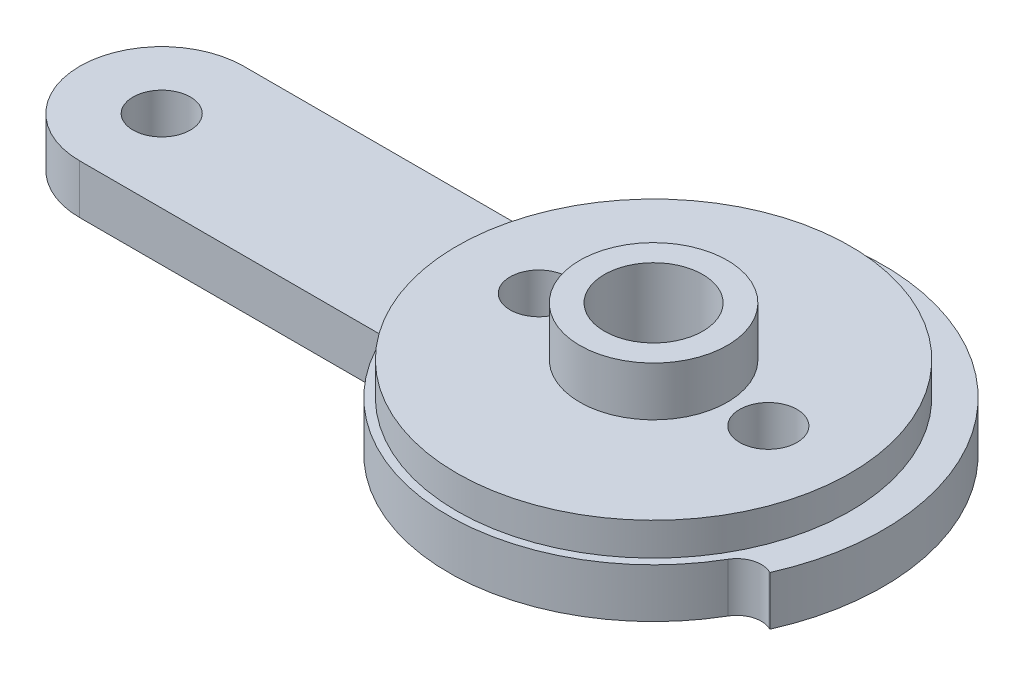
ISO-10303-21;
HEADER;
FILE_DESCRIPTION(('STEP AP214'),'2;1');
FILE_NAME('part.step','',(''),(''),'','','');
FILE_SCHEMA(('AUTOMOTIVE_DESIGN { 1 0 10303 214 1 1 1 1 }'));
ENDSEC;
DATA;
#1=APPLICATION_CONTEXT('core data for automotive mechanical design processes');
#2=APPLICATION_PROTOCOL_DEFINITION('international standard','automotive_design',2000,#1);
#3=PRODUCT_CONTEXT('',#1,'mechanical');
#4=PRODUCT('Part','Part','',(#3));
#5=PRODUCT_RELATED_PRODUCT_CATEGORY('part','',(#4));
#6=PRODUCT_DEFINITION_FORMATION('','',#4);
#7=PRODUCT_DEFINITION_CONTEXT('part definition',#1,'design');
#8=PRODUCT_DEFINITION('design','',#6,#7);
#9=PRODUCT_DEFINITION_SHAPE('','',#8);
#10=(LENGTH_UNIT() NAMED_UNIT(*) SI_UNIT(.MILLI.,.METRE.));
#11=(NAMED_UNIT(*) PLANE_ANGLE_UNIT() SI_UNIT($,.RADIAN.));
#12=(NAMED_UNIT(*) SI_UNIT($,.STERADIAN.) SOLID_ANGLE_UNIT());
#13=UNCERTAINTY_MEASURE_WITH_UNIT(LENGTH_MEASURE(1.E-05),#10,'distance_accuracy_value','');
#14=(GEOMETRIC_REPRESENTATION_CONTEXT(3) GLOBAL_UNCERTAINTY_ASSIGNED_CONTEXT((#13)) GLOBAL_UNIT_ASSIGNED_CONTEXT((#10,
#11,#12)) REPRESENTATION_CONTEXT('',''));
#15=CARTESIAN_POINT('',(0.,0.,0.));
#16=DIRECTION('',(0.,0.,1.));
#17=DIRECTION('',(1.,0.,0.));
#18=AXIS2_PLACEMENT_3D('',#15,#16,#17);
#19=CARTESIAN_POINT('',(12.1059096426056,3.,7.0318526524003));
#20=DIRECTION('',(0.,-1.,0.));
#21=DIRECTION('',(0.,0.,-1.));
#22=AXIS2_PLACEMENT_3D('',#19,#20,#21);
#23=PLANE('',#22);
#24=CARTESIAN_POINT('',(0.,3.,0.));
#25=DIRECTION('',(0.,1.,0.));
#26=DIRECTION('',(0.,0.,1.));
#27=AXIS2_PLACEMENT_3D('',#24,#25,#26);
#28=CIRCLE('',#27,12.);
#29=CARTESIAN_POINT('',(0.,3.,12.));
#30=VERTEX_POINT('',#29);
#31=EDGE_CURVE('E11',#30,#30,#28,.T.);
#32=ORIENTED_EDGE('',*,*,#31,.F.);
#33=EDGE_LOOP('',(#32));
#34=FACE_BOUND('',#33,.T.);
#35=CARTESIAN_POINT('',(12.1059096426056,3.,7.0318526524003));
#36=DIRECTION('',(0.,-1.,0.));
#37=DIRECTION('',(0.,0.,-1.));
#38=AXIS2_PLACEMENT_3D('',#35,#36,#37);
#39=CIRCLE('',#38,1.5);
#40=CARTESIAN_POINT('',(10.8088478951836,3.,6.27843986821455));
#41=VERTEX_POINT('',#40);
#42=CARTESIAN_POINT('',(12.7160146072193,3.,5.6615344659364));
#43=VERTEX_POINT('',#42);
#44=EDGE_CURVE('E189',#41,#43,#39,.T.);
#45=ORIENTED_EDGE('',*,*,#44,.T.);
#46=DIRECTION('',(0.913545457642601,0.,0.4067366430758));
#47=VECTOR('',#46,1.);
#48=CARTESIAN_POINT('',(12.7160146072193,3.,5.6615344659364));
#49=LINE('',#48,#47);
#50=CARTESIAN_POINT('',(12.7896364069964,3.,5.69431300306121));
#51=VERTEX_POINT('',#50);
#52=EDGE_CURVE('E110',#43,#51,#49,.T.);
#53=ORIENTED_EDGE('',*,*,#52,.T.);
#54=CARTESIAN_POINT('',(0.,3.,0.));
#55=DIRECTION('',(0.,1.,0.));
#56=DIRECTION('',(0.,0.,1.));
#57=AXIS2_PLACEMENT_3D('',#54,#55,#56);
#58=CIRCLE('',#57,14.);
#59=CARTESIAN_POINT('',(-8.61926065455927,3.,-11.0321505504941));
#60=VERTEX_POINT('',#59);
#61=EDGE_CURVE('E271',#51,#60,#58,.T.);
#62=ORIENTED_EDGE('',*,*,#61,.T.);
#63=DIRECTION('',(0.61566147532566,0.,0.788010753606721));
#64=VECTOR('',#63,1.);
#65=CARTESIAN_POINT('',(-8.56964505471394,3.,-10.9686454786458));
#66=LINE('',#65,#64);
#67=CARTESIAN_POINT('',(-8.56964505471394,3.,-10.9686454786458));
#68=VERTEX_POINT('',#67);
#69=EDGE_CURVE('E274',#60,#68,#66,.T.);
#70=ORIENTED_EDGE('',*,*,#69,.T.);
#71=CARTESIAN_POINT('',(-9.75166118512402,3.,-10.0451532656573));
#72=DIRECTION('',(0.,-1.,0.));
#73=DIRECTION('',(0.,0.,-1.));
#74=AXIS2_PLACEMENT_3D('',#71,#72,#73);
#75=CIRCLE('',#74,1.5);
#76=CARTESIAN_POINT('',(-8.70684034386073,3.,-8.96888684433688));
#77=VERTEX_POINT('',#76);
#78=EDGE_CURVE('E277',#68,#77,#75,.T.);
#79=ORIENTED_EDGE('',*,*,#78,.T.);
#80=CARTESIAN_POINT('',(0.,3.,0.));
#81=DIRECTION('',(0.,1.,0.));
#82=DIRECTION('',(0.,0.,1.));
#83=AXIS2_PLACEMENT_3D('',#80,#81,#82);
#84=CIRCLE('',#83,12.5);
#85=CARTESIAN_POINT('',(-11.4564392373896,3.,-5.));
#86=VERTEX_POINT('',#85);
#87=EDGE_CURVE('E280',#77,#86,#84,.T.);
#88=ORIENTED_EDGE('',*,*,#87,.T.);
#89=DIRECTION('',(-1.,0.,0.));
#90=VECTOR('',#89,1.);
#91=CARTESIAN_POINT('',(-30.,3.,-5.));
#92=LINE('',#91,#90);
#93=CARTESIAN_POINT('',(-30.,3.,-5.));
#94=VERTEX_POINT('',#93);
#95=EDGE_CURVE('E135',#86,#94,#92,.T.);
#96=ORIENTED_EDGE('',*,*,#95,.T.);
#97=CARTESIAN_POINT('',(-30.,3.,0.));
#98=DIRECTION('',(0.,1.,0.));
#99=DIRECTION('',(0.,0.,1.));
#100=AXIS2_PLACEMENT_3D('',#97,#98,#99);
#101=CIRCLE('',#100,5.);
#102=CARTESIAN_POINT('',(-30.,3.,5.));
#103=VERTEX_POINT('',#102);
#104=EDGE_CURVE('E129',#94,#103,#101,.T.);
#105=ORIENTED_EDGE('',*,*,#104,.T.);
#106=DIRECTION('',(1.,0.,0.));
#107=VECTOR('',#106,1.);
#108=CARTESIAN_POINT('',(-30.,3.,5.));
#109=LINE('',#108,#107);
#110=CARTESIAN_POINT('',(-11.4564392373896,3.,5.00000000000001));
#111=VERTEX_POINT('',#110);
#112=EDGE_CURVE('E133',#103,#111,#109,.T.);
#113=ORIENTED_EDGE('',*,*,#112,.T.);
#114=CARTESIAN_POINT('',(0.,3.,0.));
#115=DIRECTION('',(0.,1.,0.));
#116=DIRECTION('',(0.,0.,1.));
#117=AXIS2_PLACEMENT_3D('',#114,#115,#116);
#118=CIRCLE('',#117,12.5);
#119=EDGE_CURVE('E60',#111,#41,#118,.T.);
#120=ORIENTED_EDGE('',*,*,#119,.T.);
#121=EDGE_LOOP('',(#45,#53,#62,#70,#79,#88,#96,#105,#113,#120));
#122=FACE_BOUND('',#121,.T.);
#123=CARTESIAN_POINT('',(-30.,3.,0.));
#124=DIRECTION('',(0.,1.,0.));
#125=DIRECTION('',(0.,0.,1.));
#126=AXIS2_PLACEMENT_3D('',#123,#124,#125);
#127=CIRCLE('',#126,1.75);
#128=CARTESIAN_POINT('',(-30.,3.,1.75));
#129=VERTEX_POINT('',#128);
#130=EDGE_CURVE('E165',#129,#129,#127,.T.);
#131=ORIENTED_EDGE('',*,*,#130,.F.);
#132=EDGE_LOOP('',(#131));
#133=FACE_BOUND('',#132,.T.);
#134=ADVANCED_FACE('F40',(#34,#122,#133),#23,.F.);
#135=CARTESIAN_POINT('',(12.1059096426056,0.,7.0318526524003));
#136=DIRECTION('',(0.,-1.,0.));
#137=DIRECTION('',(0.,0.,-1.));
#138=AXIS2_PLACEMENT_3D('',#135,#136,#137);
#139=PLANE('',#138);
#140=CARTESIAN_POINT('',(7.,0.,0.));
#141=DIRECTION('',(0.,1.,0.));
#142=DIRECTION('',(0.,0.,1.));
#143=AXIS2_PLACEMENT_3D('',#140,#141,#142);
#144=CIRCLE('',#143,1.75);
#145=CARTESIAN_POINT('',(7.,0.,1.75));
#146=VERTEX_POINT('',#145);
#147=EDGE_CURVE('E306',#146,#146,#144,.T.);
#148=ORIENTED_EDGE('',*,*,#147,.T.);
#149=EDGE_LOOP('',(#148));
#150=FACE_BOUND('',#149,.T.);
#151=CARTESIAN_POINT('',(-7.,0.,0.));
#152=DIRECTION('',(0.,1.,0.));
#153=DIRECTION('',(0.,0.,1.));
#154=AXIS2_PLACEMENT_3D('',#151,#152,#153);
#155=CIRCLE('',#154,1.75);
#156=CARTESIAN_POINT('',(-7.,0.,1.75));
#157=VERTEX_POINT('',#156);
#158=EDGE_CURVE('E285',#157,#157,#155,.T.);
#159=ORIENTED_EDGE('',*,*,#158,.T.);
#160=EDGE_LOOP('',(#159));
#161=FACE_BOUND('',#160,.T.);
#162=CARTESIAN_POINT('',(0.,0.,0.));
#163=DIRECTION('',(0.,1.,0.));
#164=DIRECTION('',(0.,0.,1.));
#165=AXIS2_PLACEMENT_3D('',#162,#163,#164);
#166=CIRCLE('',#165,1.75);
#167=CARTESIAN_POINT('',(0.,0.,1.75));
#168=VERTEX_POINT('',#167);
#169=EDGE_CURVE('E222',#168,#168,#166,.T.);
#170=ORIENTED_EDGE('',*,*,#169,.T.);
#171=EDGE_LOOP('',(#170));
#172=FACE_BOUND('',#171,.T.);
#173=CARTESIAN_POINT('',(12.1059096426056,0.,7.0318526524003));
#174=DIRECTION('',(0.,-1.,0.));
#175=DIRECTION('',(0.,0.,-1.));
#176=AXIS2_PLACEMENT_3D('',#173,#174,#175);
#177=CIRCLE('',#176,1.5);
#178=CARTESIAN_POINT('',(10.8088478951836,0.,6.27843986821455));
#179=VERTEX_POINT('',#178);
#180=CARTESIAN_POINT('',(12.7160146072193,0.,5.6615344659364));
#181=VERTEX_POINT('',#180);
#182=EDGE_CURVE('E160',#179,#181,#177,.T.);
#183=ORIENTED_EDGE('',*,*,#182,.F.);
#184=CARTESIAN_POINT('',(0.,0.,0.));
#185=DIRECTION('',(0.,1.,0.));
#186=DIRECTION('',(0.,0.,1.));
#187=AXIS2_PLACEMENT_3D('',#184,#185,#186);
#188=CIRCLE('',#187,12.5);
#189=CARTESIAN_POINT('',(-11.4564392373896,0.,5.00000000000001));
#190=VERTEX_POINT('',#189);
#191=EDGE_CURVE('E101',#190,#179,#188,.T.);
#192=ORIENTED_EDGE('',*,*,#191,.F.);
#193=DIRECTION('',(1.,0.,0.));
#194=VECTOR('',#193,1.);
#195=CARTESIAN_POINT('',(-30.,0.,5.));
#196=LINE('',#195,#194);
#197=CARTESIAN_POINT('',(-30.,0.,5.));
#198=VERTEX_POINT('',#197);
#199=EDGE_CURVE('E95',#198,#190,#196,.T.);
#200=ORIENTED_EDGE('',*,*,#199,.F.);
#201=CARTESIAN_POINT('',(-30.,0.,0.));
#202=DIRECTION('',(0.,1.,0.));
#203=DIRECTION('',(0.,0.,1.));
#204=AXIS2_PLACEMENT_3D('',#201,#202,#203);
#205=CIRCLE('',#204,5.);
#206=CARTESIAN_POINT('',(-30.,0.,-5.));
#207=VERTEX_POINT('',#206);
#208=EDGE_CURVE('E144',#207,#198,#205,.T.);
#209=ORIENTED_EDGE('',*,*,#208,.F.);
#210=DIRECTION('',(-1.,0.,0.));
#211=VECTOR('',#210,1.);
#212=CARTESIAN_POINT('',(-30.,0.,-5.));
#213=LINE('',#212,#211);
#214=CARTESIAN_POINT('',(-11.4564392373896,0.,-5.));
#215=VERTEX_POINT('',#214);
#216=EDGE_CURVE('E180',#215,#207,#213,.T.);
#217=ORIENTED_EDGE('',*,*,#216,.F.);
#218=CARTESIAN_POINT('',(0.,0.,0.));
#219=DIRECTION('',(0.,1.,0.));
#220=DIRECTION('',(0.,0.,1.));
#221=AXIS2_PLACEMENT_3D('',#218,#219,#220);
#222=CIRCLE('',#221,12.5);
#223=CARTESIAN_POINT('',(-8.70684034386073,0.,-8.96888684433688));
#224=VERTEX_POINT('',#223);
#225=EDGE_CURVE('E177',#224,#215,#222,.T.);
#226=ORIENTED_EDGE('',*,*,#225,.F.);
#227=CARTESIAN_POINT('',(-9.75166118512402,0.,-10.0451532656573));
#228=DIRECTION('',(0.,-1.,0.));
#229=DIRECTION('',(0.,0.,-1.));
#230=AXIS2_PLACEMENT_3D('',#227,#228,#229);
#231=CIRCLE('',#230,1.5);
#232=CARTESIAN_POINT('',(-8.56964505471394,0.,-10.9686454786458));
#233=VERTEX_POINT('',#232);
#234=EDGE_CURVE('E174',#233,#224,#231,.T.);
#235=ORIENTED_EDGE('',*,*,#234,.F.);
#236=DIRECTION('',(0.61566147532566,0.,0.788010753606721));
#237=VECTOR('',#236,1.);
#238=CARTESIAN_POINT('',(-8.56964505471394,0.,-10.9686454786458));
#239=LINE('',#238,#237);
#240=CARTESIAN_POINT('',(-8.61926065455927,0.,-11.0321505504941));
#241=VERTEX_POINT('',#240);
#242=EDGE_CURVE('E171',#241,#233,#239,.T.);
#243=ORIENTED_EDGE('',*,*,#242,.F.);
#244=CARTESIAN_POINT('',(0.,0.,0.));
#245=DIRECTION('',(0.,1.,0.));
#246=DIRECTION('',(0.,0.,1.));
#247=AXIS2_PLACEMENT_3D('',#244,#245,#246);
#248=CIRCLE('',#247,14.);
#249=CARTESIAN_POINT('',(12.7896364069964,0.,5.69431300306121));
#250=VERTEX_POINT('',#249);
#251=EDGE_CURVE('E168',#250,#241,#248,.T.);
#252=ORIENTED_EDGE('',*,*,#251,.F.);
#253=DIRECTION('',(0.913545457642601,0.,0.4067366430758));
#254=VECTOR('',#253,1.);
#255=CARTESIAN_POINT('',(12.7160146072193,0.,5.6615344659364));
#256=LINE('',#255,#254);
#257=EDGE_CURVE('E164',#181,#250,#256,.T.);
#258=ORIENTED_EDGE('',*,*,#257,.F.);
#259=EDGE_LOOP('',(#183,#192,#200,#209,#217,#226,#235,#243,#252,#258));
#260=FACE_BOUND('',#259,.T.);
#261=CARTESIAN_POINT('',(-30.,0.,0.));
#262=DIRECTION('',(0.,1.,0.));
#263=DIRECTION('',(0.,0.,1.));
#264=AXIS2_PLACEMENT_3D('',#261,#262,#263);
#265=CIRCLE('',#264,1.75);
#266=CARTESIAN_POINT('',(-30.,0.,1.75));
#267=VERTEX_POINT('',#266);
#268=EDGE_CURVE('E261',#267,#267,#265,.T.);
#269=ORIENTED_EDGE('',*,*,#268,.T.);
#270=EDGE_LOOP('',(#269));
#271=FACE_BOUND('',#270,.T.);
#272=ADVANCED_FACE('F317',(#150,#161,#172,#260,#271),#139,.T.);
#273=CARTESIAN_POINT('',(12.1059096426056,3.,7.0318526524003));
#274=DIRECTION('',(0.,-1.,0.));
#275=DIRECTION('',(0.,0.,-1.));
#276=AXIS2_PLACEMENT_3D('',#273,#274,#275);
#277=CYLINDRICAL_SURFACE('',#276,1.5);
#278=ORIENTED_EDGE('',*,*,#182,.T.);
#279=DIRECTION('',(0.,-1.,0.));
#280=VECTOR('',#279,1.);
#281=CARTESIAN_POINT('',(12.7160146072193,3.,5.6615344659364));
#282=LINE('',#281,#280);
#283=EDGE_CURVE('E51',#43,#181,#282,.T.);
#284=ORIENTED_EDGE('',*,*,#283,.F.);
#285=ORIENTED_EDGE('',*,*,#44,.F.);
#286=DIRECTION('',(0.,-1.,0.));
#287=VECTOR('',#286,1.);
#288=CARTESIAN_POINT('',(10.8088478951836,3.,6.27843986821455));
#289=LINE('',#288,#287);
#290=EDGE_CURVE('E156',#41,#179,#289,.T.);
#291=ORIENTED_EDGE('',*,*,#290,.T.);
#292=EDGE_LOOP('',(#278,#284,#285,#291));
#293=FACE_BOUND('',#292,.T.);
#294=ADVANCED_FACE('F42',(#293),#277,.F.);
#295=CARTESIAN_POINT('',(12.7160146072193,3.,5.6615344659364));
#296=DIRECTION('',(0.4067366430758,0.,-0.913545457642601));
#297=DIRECTION('',(-0.913545457642601,0.,-0.4067366430758));
#298=AXIS2_PLACEMENT_3D('',#295,#296,#297);
#299=PLANE('',#298);
#300=ORIENTED_EDGE('',*,*,#257,.T.);
#301=DIRECTION('',(0.,-1.,0.));
#302=VECTOR('',#301,1.);
#303=CARTESIAN_POINT('',(12.7896364069964,3.,5.69431300306121));
#304=LINE('',#303,#302);
#305=EDGE_CURVE('E212',#51,#250,#304,.T.);
#306=ORIENTED_EDGE('',*,*,#305,.F.);
#307=ORIENTED_EDGE('',*,*,#52,.F.);
#308=ORIENTED_EDGE('',*,*,#283,.T.);
#309=EDGE_LOOP('',(#300,#306,#307,#308));
#310=FACE_BOUND('',#309,.T.);
#311=ADVANCED_FACE('F371',(#310),#299,.F.);
#312=CARTESIAN_POINT('',(0.,3.,0.));
#313=DIRECTION('',(0.,-1.,0.));
#314=DIRECTION('',(0.,0.,-1.));
#315=AXIS2_PLACEMENT_3D('',#312,#313,#314);
#316=CYLINDRICAL_SURFACE('',#315,14.);
#317=ORIENTED_EDGE('',*,*,#251,.T.);
#318=DIRECTION('',(0.,-1.,0.));
#319=VECTOR('',#318,1.);
#320=CARTESIAN_POINT('',(-8.61926065455927,3.,-11.0321505504941));
#321=LINE('',#320,#319);
#322=EDGE_CURVE('E208',#60,#241,#321,.T.);
#323=ORIENTED_EDGE('',*,*,#322,.F.);
#324=ORIENTED_EDGE('',*,*,#61,.F.);
#325=ORIENTED_EDGE('',*,*,#305,.T.);
#326=EDGE_LOOP('',(#317,#323,#324,#325));
#327=FACE_BOUND('',#326,.T.);
#328=ADVANCED_FACE('F368',(#327),#316,.T.);
#329=CARTESIAN_POINT('',(-8.56964505471394,3.,-10.9686454786458));
#330=DIRECTION('',(0.788010753606721,0.,-0.61566147532566));
#331=DIRECTION('',(-0.61566147532566,0.,-0.788010753606721));
#332=AXIS2_PLACEMENT_3D('',#329,#330,#331);
#333=PLANE('',#332);
#334=ORIENTED_EDGE('',*,*,#242,.T.);
#335=DIRECTION('',(0.,-1.,0.));
#336=VECTOR('',#335,1.);
#337=CARTESIAN_POINT('',(-8.56964505471394,3.,-10.9686454786458));
#338=LINE('',#337,#336);
#339=EDGE_CURVE('E204',#68,#233,#338,.T.);
#340=ORIENTED_EDGE('',*,*,#339,.F.);
#341=ORIENTED_EDGE('',*,*,#69,.F.);
#342=ORIENTED_EDGE('',*,*,#322,.T.);
#343=EDGE_LOOP('',(#334,#340,#341,#342));
#344=FACE_BOUND('',#343,.T.);
#345=ADVANCED_FACE('F364',(#344),#333,.F.);
#346=CARTESIAN_POINT('',(-9.75166118512402,3.,-10.0451532656573));
#347=DIRECTION('',(0.,-1.,0.));
#348=DIRECTION('',(0.,0.,-1.));
#349=AXIS2_PLACEMENT_3D('',#346,#347,#348);
#350=CYLINDRICAL_SURFACE('',#349,1.5);
#351=ORIENTED_EDGE('',*,*,#234,.T.);
#352=DIRECTION('',(0.,-1.,0.));
#353=VECTOR('',#352,1.);
#354=CARTESIAN_POINT('',(-8.70684034386073,3.,-8.96888684433688));
#355=LINE('',#354,#353);
#356=EDGE_CURVE('E200',#77,#224,#355,.T.);
#357=ORIENTED_EDGE('',*,*,#356,.F.);
#358=ORIENTED_EDGE('',*,*,#78,.F.);
#359=ORIENTED_EDGE('',*,*,#339,.T.);
#360=EDGE_LOOP('',(#351,#357,#358,#359));
#361=FACE_BOUND('',#360,.T.);
#362=ADVANCED_FACE('F360',(#361),#350,.F.);
#363=CARTESIAN_POINT('',(0.,3.,0.));
#364=DIRECTION('',(0.,-1.,0.));
#365=DIRECTION('',(0.,0.,-1.));
#366=AXIS2_PLACEMENT_3D('',#363,#364,#365);
#367=CYLINDRICAL_SURFACE('',#366,12.5);
#368=ORIENTED_EDGE('',*,*,#225,.T.);
#369=DIRECTION('',(0.,-1.,0.));
#370=VECTOR('',#369,1.);
#371=CARTESIAN_POINT('',(-11.4564392373896,3.,-5.));
#372=LINE('',#371,#370);
#373=EDGE_CURVE('E196',#86,#215,#372,.T.);
#374=ORIENTED_EDGE('',*,*,#373,.F.);
#375=ORIENTED_EDGE('',*,*,#87,.F.);
#376=ORIENTED_EDGE('',*,*,#356,.T.);
#377=EDGE_LOOP('',(#368,#374,#375,#376));
#378=FACE_BOUND('',#377,.T.);
#379=ADVANCED_FACE('F356',(#378),#367,.T.);
#380=CARTESIAN_POINT('',(-30.,3.,-5.));
#381=DIRECTION('',(0.,0.,1.));
#382=DIRECTION('',(1.,0.,0.));
#383=AXIS2_PLACEMENT_3D('',#380,#381,#382);
#384=PLANE('',#383);
#385=ORIENTED_EDGE('',*,*,#216,.T.);
#386=DIRECTION('',(0.,-1.,0.));
#387=VECTOR('',#386,1.);
#388=CARTESIAN_POINT('',(-30.,3.,-5.));
#389=LINE('',#388,#387);
#390=EDGE_CURVE('E146',#94,#207,#389,.T.);
#391=ORIENTED_EDGE('',*,*,#390,.F.);
#392=ORIENTED_EDGE('',*,*,#95,.F.);
#393=ORIENTED_EDGE('',*,*,#373,.T.);
#394=EDGE_LOOP('',(#385,#391,#392,#393));
#395=FACE_BOUND('',#394,.T.);
#396=ADVANCED_FACE('F353',(#395),#384,.F.);
#397=CARTESIAN_POINT('',(-30.,3.,0.));
#398=DIRECTION('',(0.,-1.,0.));
#399=DIRECTION('',(0.,0.,-1.));
#400=AXIS2_PLACEMENT_3D('',#397,#398,#399);
#401=CYLINDRICAL_SURFACE('',#400,5.);
#402=ORIENTED_EDGE('',*,*,#208,.T.);
#403=DIRECTION('',(0.,-1.,0.));
#404=VECTOR('',#403,1.);
#405=CARTESIAN_POINT('',(-30.,3.,5.));
#406=LINE('',#405,#404);
#407=EDGE_CURVE('E141',#103,#198,#406,.T.);
#408=ORIENTED_EDGE('',*,*,#407,.F.);
#409=ORIENTED_EDGE('',*,*,#104,.F.);
#410=ORIENTED_EDGE('',*,*,#390,.T.);
#411=EDGE_LOOP('',(#402,#408,#409,#410));
#412=FACE_BOUND('',#411,.T.);
#413=ADVANCED_FACE('F142',(#412),#401,.T.);
#414=CARTESIAN_POINT('',(-30.,3.,5.));
#415=DIRECTION('',(0.,0.,-1.));
#416=DIRECTION('',(-1.,0.,0.));
#417=AXIS2_PLACEMENT_3D('',#414,#415,#416);
#418=PLANE('',#417);
#419=ORIENTED_EDGE('',*,*,#199,.T.);
#420=DIRECTION('',(0.,-1.,0.));
#421=VECTOR('',#420,1.);
#422=CARTESIAN_POINT('',(-11.4564392373896,3.,5.00000000000001));
#423=LINE('',#422,#421);
#424=EDGE_CURVE('E147',#111,#190,#423,.T.);
#425=ORIENTED_EDGE('',*,*,#424,.F.);
#426=ORIENTED_EDGE('',*,*,#112,.F.);
#427=ORIENTED_EDGE('',*,*,#407,.T.);
#428=EDGE_LOOP('',(#419,#425,#426,#427));
#429=FACE_BOUND('',#428,.T.);
#430=ADVANCED_FACE('F149',(#429),#418,.F.);
#431=CARTESIAN_POINT('',(0.,3.,0.));
#432=DIRECTION('',(0.,-1.,0.));
#433=DIRECTION('',(0.,0.,-1.));
#434=AXIS2_PLACEMENT_3D('',#431,#432,#433);
#435=CYLINDRICAL_SURFACE('',#434,12.5);
#436=ORIENTED_EDGE('',*,*,#191,.T.);
#437=ORIENTED_EDGE('',*,*,#290,.F.);
#438=ORIENTED_EDGE('',*,*,#119,.F.);
#439=ORIENTED_EDGE('',*,*,#424,.T.);
#440=EDGE_LOOP('',(#436,#437,#438,#439));
#441=FACE_BOUND('',#440,.T.);
#442=ADVANCED_FACE('F346',(#441),#435,.T.);
#443=CARTESIAN_POINT('',(-30.,3.,0.));
#444=DIRECTION('',(0.,-1.,0.));
#445=DIRECTION('',(0.,0.,-1.));
#446=AXIS2_PLACEMENT_3D('',#443,#444,#445);
#447=CYLINDRICAL_SURFACE('',#446,1.75);
#448=ORIENTED_EDGE('',*,*,#130,.T.);
#449=EDGE_LOOP('',(#448));
#450=FACE_BOUND('',#449,.T.);
#451=ORIENTED_EDGE('',*,*,#268,.F.);
#452=EDGE_LOOP('',(#451));
#453=FACE_BOUND('',#452,.T.);
#454=ADVANCED_FACE('F343',(#450,#453),#447,.F.);
#455=CARTESIAN_POINT('',(0.,5.,0.));
#456=DIRECTION('',(0.,-1.,0.));
#457=DIRECTION('',(0.,0.,-1.));
#458=AXIS2_PLACEMENT_3D('',#455,#456,#457);
#459=CYLINDRICAL_SURFACE('',#458,12.);
#460=CARTESIAN_POINT('',(0.,5.,0.));
#461=DIRECTION('',(0.,1.,0.));
#462=DIRECTION('',(0.,0.,1.));
#463=AXIS2_PLACEMENT_3D('',#460,#461,#462);
#464=CIRCLE('',#463,12.);
#465=CARTESIAN_POINT('',(0.,5.,12.));
#466=VERTEX_POINT('',#465);
#467=EDGE_CURVE('E255',#466,#466,#464,.T.);
#468=ORIENTED_EDGE('',*,*,#467,.F.);
#469=EDGE_LOOP('',(#468));
#470=FACE_BOUND('',#469,.T.);
#471=ORIENTED_EDGE('',*,*,#31,.T.);
#472=EDGE_LOOP('',(#471));
#473=FACE_BOUND('',#472,.T.);
#474=ADVANCED_FACE('F399',(#470,#473),#459,.T.);
#475=CARTESIAN_POINT('',(0.,5.,0.));
#476=DIRECTION('',(0.,1.,0.));
#477=DIRECTION('',(0.,0.,1.));
#478=AXIS2_PLACEMENT_3D('',#475,#476,#477);
#479=PLANE('',#478);
#480=CARTESIAN_POINT('',(7.,5.,0.));
#481=DIRECTION('',(0.,1.,0.));
#482=DIRECTION('',(0.,0.,1.));
#483=AXIS2_PLACEMENT_3D('',#480,#481,#482);
#484=CIRCLE('',#483,1.75);
#485=CARTESIAN_POINT('',(7.,5.,1.75));
#486=VERTEX_POINT('',#485);
#487=EDGE_CURVE('E44',#486,#486,#484,.T.);
#488=ORIENTED_EDGE('',*,*,#487,.F.);
#489=EDGE_LOOP('',(#488));
#490=FACE_BOUND('',#489,.T.);
#491=CARTESIAN_POINT('',(-7.,5.,0.));
#492=DIRECTION('',(0.,1.,0.));
#493=DIRECTION('',(0.,0.,1.));
#494=AXIS2_PLACEMENT_3D('',#491,#492,#493);
#495=CIRCLE('',#494,1.75);
#496=CARTESIAN_POINT('',(-7.,5.,1.75));
#497=VERTEX_POINT('',#496);
#498=EDGE_CURVE('E221',#497,#497,#495,.T.);
#499=ORIENTED_EDGE('',*,*,#498,.F.);
#500=EDGE_LOOP('',(#499));
#501=FACE_BOUND('',#500,.T.);
#502=CARTESIAN_POINT('',(0.,5.,0.));
#503=DIRECTION('',(0.,1.,0.));
#504=DIRECTION('',(0.,0.,1.));
#505=AXIS2_PLACEMENT_3D('',#502,#503,#504);
#506=CIRCLE('',#505,4.5);
#507=CARTESIAN_POINT('',(0.,5.,4.5));
#508=VERTEX_POINT('',#507);
#509=EDGE_CURVE('E246',#508,#508,#506,.T.);
#510=ORIENTED_EDGE('',*,*,#509,.F.);
#511=EDGE_LOOP('',(#510));
#512=FACE_BOUND('',#511,.T.);
#513=ORIENTED_EDGE('',*,*,#467,.T.);
#514=EDGE_LOOP('',(#513));
#515=FACE_BOUND('',#514,.T.);
#516=ADVANCED_FACE('F404',(#490,#501,#512,#515),#479,.T.);
#517=CARTESIAN_POINT('',(0.,8.,0.));
#518=DIRECTION('',(0.,1.,0.));
#519=DIRECTION('',(0.,0.,1.));
#520=AXIS2_PLACEMENT_3D('',#517,#518,#519);
#521=PLANE('',#520);
#522=CARTESIAN_POINT('',(0.,8.,0.));
#523=DIRECTION('',(0.,1.,0.));
#524=DIRECTION('',(0.,0.,1.));
#525=AXIS2_PLACEMENT_3D('',#522,#523,#524);
#526=CIRCLE('',#525,4.5);
#527=CARTESIAN_POINT('',(0.,8.,4.5));
#528=VERTEX_POINT('',#527);
#529=EDGE_CURVE('E251',#528,#528,#526,.T.);
#530=ORIENTED_EDGE('',*,*,#529,.T.);
#531=EDGE_LOOP('',(#530));
#532=FACE_BOUND('',#531,.T.);
#533=CARTESIAN_POINT('',(0.,8.,0.));
#534=DIRECTION('',(0.,1.,0.));
#535=DIRECTION('',(0.,0.,1.));
#536=AXIS2_PLACEMENT_3D('',#533,#534,#535);
#537=CIRCLE('',#536,3.);
#538=CARTESIAN_POINT('',(0.,8.,3.));
#539=VERTEX_POINT('',#538);
#540=EDGE_CURVE('E239',#539,#539,#537,.T.);
#541=ORIENTED_EDGE('',*,*,#540,.F.);
#542=EDGE_LOOP('',(#541));
#543=FACE_BOUND('',#542,.T.);
#544=ADVANCED_FACE('F410',(#532,#543),#521,.T.);
#545=CARTESIAN_POINT('',(0.,8.,0.));
#546=DIRECTION('',(0.,-1.,0.));
#547=DIRECTION('',(0.,0.,-1.));
#548=AXIS2_PLACEMENT_3D('',#545,#546,#547);
#549=CYLINDRICAL_SURFACE('',#548,4.5);
#550=ORIENTED_EDGE('',*,*,#529,.F.);
#551=EDGE_LOOP('',(#550));
#552=FACE_BOUND('',#551,.T.);
#553=ORIENTED_EDGE('',*,*,#509,.T.);
#554=EDGE_LOOP('',(#553));
#555=FACE_BOUND('',#554,.T.);
#556=ADVANCED_FACE('F416',(#552,#555),#549,.T.);
#557=CARTESIAN_POINT('',(0.,8.,0.));
#558=DIRECTION('',(0.,-1.,0.));
#559=DIRECTION('',(0.,0.,-1.));
#560=AXIS2_PLACEMENT_3D('',#557,#558,#559);
#561=CYLINDRICAL_SURFACE('',#560,3.);
#562=ORIENTED_EDGE('',*,*,#540,.T.);
#563=EDGE_LOOP('',(#562));
#564=FACE_BOUND('',#563,.T.);
#565=CARTESIAN_POINT('',(0.,3.,0.));
#566=DIRECTION('',(0.,1.,0.));
#567=DIRECTION('',(0.,0.,1.));
#568=AXIS2_PLACEMENT_3D('',#565,#566,#567);
#569=CIRCLE('',#568,3.);
#570=CARTESIAN_POINT('',(0.,3.,3.));
#571=VERTEX_POINT('',#570);
#572=EDGE_CURVE('E230',#571,#571,#569,.T.);
#573=ORIENTED_EDGE('',*,*,#572,.F.);
#574=EDGE_LOOP('',(#573));
#575=FACE_BOUND('',#574,.T.);
#576=ADVANCED_FACE('F419',(#564,#575),#561,.F.);
#577=CARTESIAN_POINT('',(0.,3.,0.));
#578=DIRECTION('',(0.,1.,0.));
#579=DIRECTION('',(0.,0.,1.));
#580=AXIS2_PLACEMENT_3D('',#577,#578,#579);
#581=PLANE('',#580);
#582=CARTESIAN_POINT('',(0.,3.,0.));
#583=DIRECTION('',(0.,1.,0.));
#584=DIRECTION('',(0.,0.,1.));
#585=AXIS2_PLACEMENT_3D('',#582,#583,#584);
#586=CIRCLE('',#585,1.75);
#587=CARTESIAN_POINT('',(0.,3.,1.75));
#588=VERTEX_POINT('',#587);
#589=EDGE_CURVE('E218',#588,#588,#586,.T.);
#590=ORIENTED_EDGE('',*,*,#589,.F.);
#591=EDGE_LOOP('',(#590));
#592=FACE_BOUND('',#591,.T.);
#593=ORIENTED_EDGE('',*,*,#572,.T.);
#594=EDGE_LOOP('',(#593));
#595=FACE_BOUND('',#594,.T.);
#596=ADVANCED_FACE('F330',(#592,#595),#581,.T.);
#597=CARTESIAN_POINT('',(0.,0.,0.));
#598=DIRECTION('',(0.,1.,0.));
#599=DIRECTION('',(0.,0.,1.));
#600=AXIS2_PLACEMENT_3D('',#597,#598,#599);
#601=CYLINDRICAL_SURFACE('',#600,1.75);
#602=ORIENTED_EDGE('',*,*,#589,.T.);
#603=EDGE_LOOP('',(#602));
#604=FACE_BOUND('',#603,.T.);
#605=ORIENTED_EDGE('',*,*,#169,.F.);
#606=EDGE_LOOP('',(#605));
#607=FACE_BOUND('',#606,.T.);
#608=ADVANCED_FACE('F323',(#604,#607),#601,.F.);
#609=CARTESIAN_POINT('',(-7.,0.,0.));
#610=DIRECTION('',(0.,1.,0.));
#611=DIRECTION('',(0.,0.,1.));
#612=AXIS2_PLACEMENT_3D('',#609,#610,#611);
#613=CYLINDRICAL_SURFACE('',#612,1.75);
#614=ORIENTED_EDGE('',*,*,#498,.T.);
#615=EDGE_LOOP('',(#614));
#616=FACE_BOUND('',#615,.T.);
#617=ORIENTED_EDGE('',*,*,#158,.F.);
#618=EDGE_LOOP('',(#617));
#619=FACE_BOUND('',#618,.T.);
#620=ADVANCED_FACE('F320',(#616,#619),#613,.F.);
#621=CARTESIAN_POINT('',(7.,0.,0.));
#622=DIRECTION('',(0.,1.,0.));
#623=DIRECTION('',(0.,0.,1.));
#624=AXIS2_PLACEMENT_3D('',#621,#622,#623);
#625=CYLINDRICAL_SURFACE('',#624,1.75);
#626=ORIENTED_EDGE('',*,*,#487,.T.);
#627=EDGE_LOOP('',(#626));
#628=FACE_BOUND('',#627,.T.);
#629=ORIENTED_EDGE('',*,*,#147,.F.);
#630=EDGE_LOOP('',(#629));
#631=FACE_BOUND('',#630,.T.);
#632=ADVANCED_FACE('F322',(#628,#631),#625,.F.);
#633=CLOSED_SHELL('',(#134,#272,#294,#311,#328,#345,#362,#379,#396,#413,#430,#442,#454,#474,
#516,#544,#556,#576,#596,#608,#620,#632));
#634=MANIFOLD_SOLID_BREP('B2',#633);
#635=ADVANCED_BREP_SHAPE_REPRESENTATION('',(#18,#634),#14);
#636=SHAPE_DEFINITION_REPRESENTATION(#9,#635);
ENDSEC;
END-ISO-10303-21;
